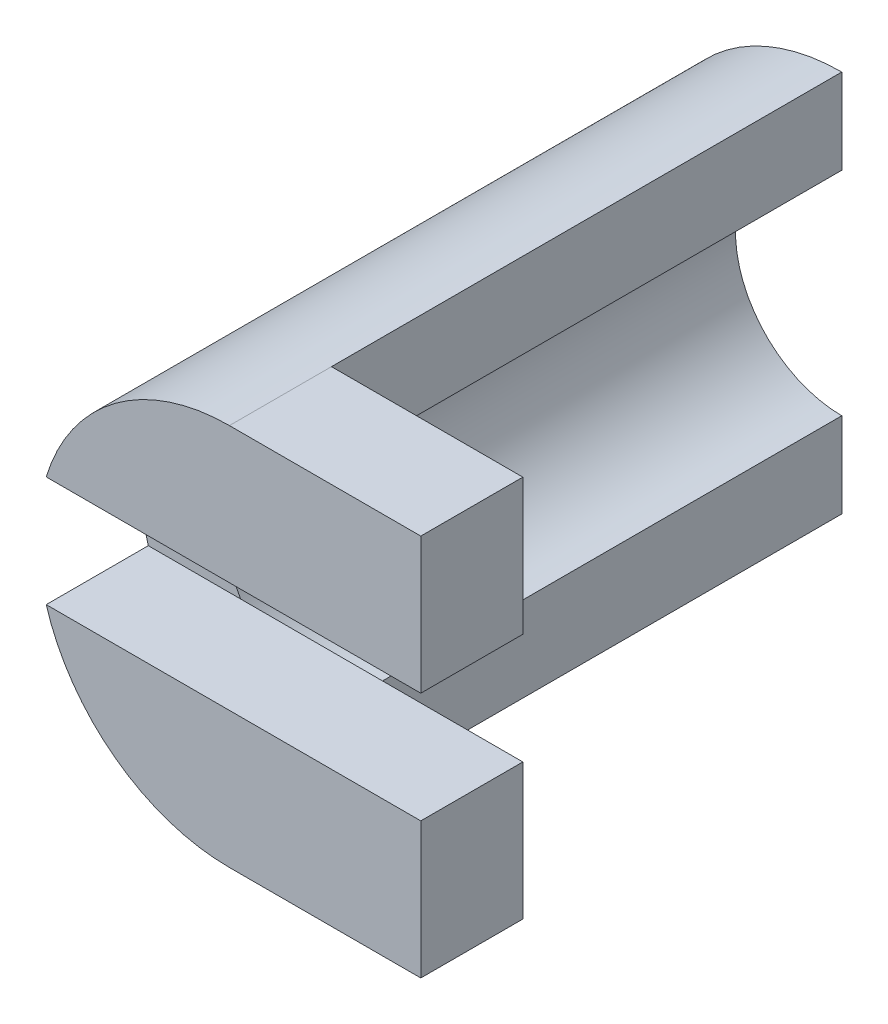
ISO-10303-21;
HEADER;
FILE_DESCRIPTION(('STEP AP214'),'2;1');
FILE_NAME('part.step','',(''),(''),'','','');
FILE_SCHEMA(('AUTOMOTIVE_DESIGN { 1 0 10303 214 1 1 1 1 }'));
ENDSEC;
DATA;
#1=APPLICATION_CONTEXT('core data for automotive mechanical design processes');
#2=APPLICATION_PROTOCOL_DEFINITION('international standard','automotive_design',2000,#1);
#3=PRODUCT_CONTEXT('',#1,'mechanical');
#4=PRODUCT('Part','Part','',(#3));
#5=PRODUCT_RELATED_PRODUCT_CATEGORY('part','',(#4));
#6=PRODUCT_DEFINITION_FORMATION('','',#4);
#7=PRODUCT_DEFINITION_CONTEXT('part definition',#1,'design');
#8=PRODUCT_DEFINITION('design','',#6,#7);
#9=PRODUCT_DEFINITION_SHAPE('','',#8);
#10=(LENGTH_UNIT() NAMED_UNIT(*) SI_UNIT(.MILLI.,.METRE.));
#11=(NAMED_UNIT(*) PLANE_ANGLE_UNIT() SI_UNIT($,.RADIAN.));
#12=(NAMED_UNIT(*) SI_UNIT($,.STERADIAN.) SOLID_ANGLE_UNIT());
#13=UNCERTAINTY_MEASURE_WITH_UNIT(LENGTH_MEASURE(1.E-05),#10,'distance_accuracy_value','');
#14=(GEOMETRIC_REPRESENTATION_CONTEXT(3) GLOBAL_UNCERTAINTY_ASSIGNED_CONTEXT((#13)) GLOBAL_UNIT_ASSIGNED_CONTEXT((#10,
#11,#12)) REPRESENTATION_CONTEXT('',''));
#15=CARTESIAN_POINT('',(0.,0.,0.));
#16=DIRECTION('',(0.,0.,1.));
#17=DIRECTION('',(1.,0.,0.));
#18=AXIS2_PLACEMENT_3D('',#15,#16,#17);
#19=CARTESIAN_POINT('',(0.,0.,30.));
#20=DIRECTION('',(0.,0.,-1.));
#21=DIRECTION('',(-1.,0.,0.));
#22=AXIS2_PLACEMENT_3D('',#19,#20,#21);
#23=CYLINDRICAL_SURFACE('',#22,6.25);
#24=CARTESIAN_POINT('',(0.,0.,0.));
#25=DIRECTION('',(0.,0.,-1.));
#26=DIRECTION('',(1.,0.,0.));
#27=AXIS2_PLACEMENT_3D('',#24,#25,#26);
#28=CIRCLE('',#27,6.25);
#29=CARTESIAN_POINT('',(0.,-6.25,0.));
#30=VERTEX_POINT('',#29);
#31=CARTESIAN_POINT('',(0.,6.25,0.));
#32=VERTEX_POINT('',#31);
#33=EDGE_CURVE('E197',#30,#32,#28,.T.);
#34=ORIENTED_EDGE('',*,*,#33,.T.);
#35=DIRECTION('',(0.,0.,-1.));
#36=VECTOR('',#35,1.);
#37=CARTESIAN_POINT('',(0.,6.25,30.));
#38=LINE('',#37,#36);
#39=CARTESIAN_POINT('',(0.,6.25,30.));
#40=VERTEX_POINT('',#39);
#41=EDGE_CURVE('E11',#40,#32,#38,.T.);
#42=ORIENTED_EDGE('',*,*,#41,.F.);
#43=CARTESIAN_POINT('',(0.,0.,30.));
#44=DIRECTION('',(0.,0.,-1.));
#45=DIRECTION('',(1.,0.,0.));
#46=AXIS2_PLACEMENT_3D('',#43,#44,#45);
#47=CIRCLE('',#46,6.25);
#48=CARTESIAN_POINT('',(-5.33853912601566,3.25,30.));
#49=VERTEX_POINT('',#48);
#50=EDGE_CURVE('E203',#49,#40,#47,.T.);
#51=ORIENTED_EDGE('',*,*,#50,.F.);
#52=CARTESIAN_POINT('',(-5.33853912601566,-3.25,30.));
#53=VERTEX_POINT('',#52);
#54=EDGE_CURVE('E202',#53,#49,#47,.T.);
#55=ORIENTED_EDGE('',*,*,#54,.F.);
#56=CARTESIAN_POINT('',(0.,-6.25,30.));
#57=VERTEX_POINT('',#56);
#58=EDGE_CURVE('E198',#57,#53,#47,.T.);
#59=ORIENTED_EDGE('',*,*,#58,.F.);
#60=DIRECTION('',(0.,0.,-1.));
#61=VECTOR('',#60,1.);
#62=CARTESIAN_POINT('',(0.,-6.25,30.));
#63=LINE('',#62,#61);
#64=EDGE_CURVE('E210',#57,#30,#63,.T.);
#65=ORIENTED_EDGE('',*,*,#64,.T.);
#66=EDGE_LOOP('',(#34,#42,#51,#55,#59,#65));
#67=FACE_BOUND('',#66,.T.);
#68=ADVANCED_FACE('F39',(#67),#23,.F.);
#69=CARTESIAN_POINT('',(0.,6.25,30.));
#70=DIRECTION('',(-1.,0.,0.));
#71=DIRECTION('',(0.,-1.,0.));
#72=AXIS2_PLACEMENT_3D('',#69,#70,#71);
#73=PLANE('',#72);
#74=DIRECTION('',(0.,1.,0.));
#75=VECTOR('',#74,1.);
#76=CARTESIAN_POINT('',(0.,6.25,0.));
#77=LINE('',#76,#75);
#78=CARTESIAN_POINT('',(0.,11.25,0.));
#79=VERTEX_POINT('',#78);
#80=EDGE_CURVE('E213',#32,#79,#77,.T.);
#81=ORIENTED_EDGE('',*,*,#80,.T.);
#82=DIRECTION('',(0.,0.,-1.));
#83=VECTOR('',#82,1.);
#84=CARTESIAN_POINT('',(0.,11.25,30.));
#85=LINE('',#84,#83);
#86=CARTESIAN_POINT('',(0.,11.25,30.));
#87=VERTEX_POINT('',#86);
#88=EDGE_CURVE('E46',#87,#79,#85,.T.);
#89=ORIENTED_EDGE('',*,*,#88,.F.);
#90=DIRECTION('',(0.,1.,0.));
#91=VECTOR('',#90,1.);
#92=CARTESIAN_POINT('',(0.,6.25,30.));
#93=LINE('',#92,#91);
#94=EDGE_CURVE('E201',#40,#87,#93,.T.);
#95=ORIENTED_EDGE('',*,*,#94,.F.);
#96=ORIENTED_EDGE('',*,*,#41,.T.);
#97=EDGE_LOOP('',(#81,#89,#95,#96));
#98=FACE_BOUND('',#97,.T.);
#99=ADVANCED_FACE('F256',(#98),#73,.F.);
#100=CARTESIAN_POINT('',(0.,0.,30.));
#101=DIRECTION('',(0.,0.,-1.));
#102=DIRECTION('',(-1.,0.,0.));
#103=AXIS2_PLACEMENT_3D('',#100,#101,#102);
#104=CYLINDRICAL_SURFACE('',#103,11.25);
#105=CARTESIAN_POINT('',(0.,0.,0.));
#106=DIRECTION('',(0.,0.,1.));
#107=DIRECTION('',(1.,0.,0.));
#108=AXIS2_PLACEMENT_3D('',#105,#106,#107);
#109=CIRCLE('',#108,11.25);
#110=CARTESIAN_POINT('',(0.,-11.25,0.));
#111=VERTEX_POINT('',#110);
#112=EDGE_CURVE('E215',#79,#111,#109,.T.);
#113=ORIENTED_EDGE('',*,*,#112,.T.);
#114=DIRECTION('',(0.,0.,-1.));
#115=VECTOR('',#114,1.);
#116=CARTESIAN_POINT('',(0.,-11.25,30.));
#117=LINE('',#116,#115);
#118=CARTESIAN_POINT('',(0.,-11.25,30.));
#119=VERTEX_POINT('',#118);
#120=EDGE_CURVE('E221',#119,#111,#117,.T.);
#121=ORIENTED_EDGE('',*,*,#120,.F.);
#122=DIRECTION('',(0.,0.,-1.));
#123=VECTOR('',#122,1.);
#124=CARTESIAN_POINT('',(0.,-11.25,36.));
#125=LINE('',#124,#123);
#126=CARTESIAN_POINT('',(0.,-11.25,36.));
#127=VERTEX_POINT('',#126);
#128=EDGE_CURVE('E135',#127,#119,#125,.T.);
#129=ORIENTED_EDGE('',*,*,#128,.F.);
#130=CARTESIAN_POINT('',(0.,0.,36.));
#131=DIRECTION('',(0.,0.,1.));
#132=DIRECTION('',(1.,0.,0.));
#133=AXIS2_PLACEMENT_3D('',#130,#131,#132);
#134=CIRCLE('',#133,11.25);
#135=CARTESIAN_POINT('',(-10.770329614269,-3.25,36.));
#136=VERTEX_POINT('',#135);
#137=EDGE_CURVE('E138',#136,#127,#134,.T.);
#138=ORIENTED_EDGE('',*,*,#137,.F.);
#139=DIRECTION('',(0.,0.,-1.));
#140=VECTOR('',#139,1.);
#141=CARTESIAN_POINT('',(-10.770329614269,-3.25,36.));
#142=LINE('',#141,#140);
#143=CARTESIAN_POINT('',(-10.770329614269,-3.25,30.));
#144=VERTEX_POINT('',#143);
#145=EDGE_CURVE('E125',#136,#144,#142,.T.);
#146=ORIENTED_EDGE('',*,*,#145,.T.);
#147=CARTESIAN_POINT('',(0.,0.,30.));
#148=DIRECTION('',(0.,0.,1.));
#149=DIRECTION('',(1.,0.,0.));
#150=AXIS2_PLACEMENT_3D('',#147,#148,#149);
#151=CIRCLE('',#150,11.25);
#152=CARTESIAN_POINT('',(-10.770329614269,3.25,30.));
#153=VERTEX_POINT('',#152);
#154=EDGE_CURVE('E58',#153,#144,#151,.T.);
#155=ORIENTED_EDGE('',*,*,#154,.F.);
#156=DIRECTION('',(0.,0.,-1.));
#157=VECTOR('',#156,1.);
#158=CARTESIAN_POINT('',(-10.770329614269,3.25,36.));
#159=LINE('',#158,#157);
#160=CARTESIAN_POINT('',(-10.770329614269,3.25,36.));
#161=VERTEX_POINT('',#160);
#162=EDGE_CURVE('E194',#161,#153,#159,.T.);
#163=ORIENTED_EDGE('',*,*,#162,.F.);
#164=CARTESIAN_POINT('',(0.,0.,36.));
#165=DIRECTION('',(0.,0.,1.));
#166=DIRECTION('',(1.,0.,0.));
#167=AXIS2_PLACEMENT_3D('',#164,#165,#166);
#168=CIRCLE('',#167,11.25);
#169=CARTESIAN_POINT('',(0.,11.25,36.));
#170=VERTEX_POINT('',#169);
#171=EDGE_CURVE('E167',#170,#161,#168,.T.);
#172=ORIENTED_EDGE('',*,*,#171,.F.);
#173=DIRECTION('',(0.,0.,-1.));
#174=VECTOR('',#173,1.);
#175=CARTESIAN_POINT('',(0.,11.25,36.));
#176=LINE('',#175,#174);
#177=EDGE_CURVE('E178',#170,#87,#176,.T.);
#178=ORIENTED_EDGE('',*,*,#177,.T.);
#179=ORIENTED_EDGE('',*,*,#88,.T.);
#180=EDGE_LOOP('',(#113,#121,#129,#138,#146,#155,#163,#172,#178,#179));
#181=FACE_BOUND('',#180,.T.);
#182=ADVANCED_FACE('F139',(#181),#104,.T.);
#183=CARTESIAN_POINT('',(0.,-6.25,30.));
#184=DIRECTION('',(-1.,0.,0.));
#185=DIRECTION('',(0.,-1.,0.));
#186=AXIS2_PLACEMENT_3D('',#183,#184,#185);
#187=PLANE('',#186);
#188=DIRECTION('',(0.,1.,0.));
#189=VECTOR('',#188,1.);
#190=CARTESIAN_POINT('',(0.,-6.25,0.));
#191=LINE('',#190,#189);
#192=EDGE_CURVE('E217',#111,#30,#191,.T.);
#193=ORIENTED_EDGE('',*,*,#192,.T.);
#194=ORIENTED_EDGE('',*,*,#64,.F.);
#195=DIRECTION('',(0.,1.,0.));
#196=VECTOR('',#195,1.);
#197=CARTESIAN_POINT('',(0.,-6.25,30.));
#198=LINE('',#197,#196);
#199=EDGE_CURVE('E207',#119,#57,#198,.T.);
#200=ORIENTED_EDGE('',*,*,#199,.F.);
#201=ORIENTED_EDGE('',*,*,#120,.T.);
#202=EDGE_LOOP('',(#193,#194,#200,#201));
#203=FACE_BOUND('',#202,.T.);
#204=ADVANCED_FACE('F233',(#203),#187,.F.);
#205=CARTESIAN_POINT('',(0.,0.,30.));
#206=DIRECTION('',(0.,0.,1.));
#207=DIRECTION('',(1.,0.,0.));
#208=AXIS2_PLACEMENT_3D('',#205,#206,#207);
#209=PLANE('',#208);
#210=DIRECTION('',(1.,0.,0.));
#211=VECTOR('',#210,1.);
#212=CARTESIAN_POINT('',(0.,-3.25,30.));
#213=LINE('',#212,#211);
#214=EDGE_CURVE('E53',#144,#53,#213,.T.);
#215=ORIENTED_EDGE('',*,*,#214,.T.);
#216=ORIENTED_EDGE('',*,*,#54,.T.);
#217=DIRECTION('',(1.,0.,0.));
#218=VECTOR('',#217,1.);
#219=CARTESIAN_POINT('',(0.,3.25,30.));
#220=LINE('',#219,#218);
#221=EDGE_CURVE('E179',#153,#49,#220,.T.);
#222=ORIENTED_EDGE('',*,*,#221,.F.);
#223=ORIENTED_EDGE('',*,*,#154,.T.);
#224=EDGE_LOOP('',(#215,#216,#222,#223));
#225=FACE_BOUND('',#224,.T.);
#226=ADVANCED_FACE('F268',(#225),#209,.T.);
#227=CARTESIAN_POINT('',(0.,0.,0.));
#228=DIRECTION('',(0.,0.,1.));
#229=DIRECTION('',(1.,0.,0.));
#230=AXIS2_PLACEMENT_3D('',#227,#228,#229);
#231=PLANE('',#230);
#232=ORIENTED_EDGE('',*,*,#33,.F.);
#233=ORIENTED_EDGE('',*,*,#192,.F.);
#234=ORIENTED_EDGE('',*,*,#112,.F.);
#235=ORIENTED_EDGE('',*,*,#80,.F.);
#236=EDGE_LOOP('',(#232,#233,#234,#235));
#237=FACE_BOUND('',#236,.T.);
#238=ADVANCED_FACE('F231',(#237),#231,.F.);
#239=CARTESIAN_POINT('',(0.,0.,30.));
#240=DIRECTION('',(0.,0.,1.));
#241=DIRECTION('',(1.,0.,0.));
#242=AXIS2_PLACEMENT_3D('',#239,#240,#241);
#243=PLANE('',#242);
#244=CARTESIAN_POINT('',(11.25,3.25,30.));
#245=VERTEX_POINT('',#244);
#246=EDGE_CURVE('E134',#49,#245,#220,.T.);
#247=ORIENTED_EDGE('',*,*,#246,.F.);
#248=ORIENTED_EDGE('',*,*,#50,.T.);
#249=ORIENTED_EDGE('',*,*,#94,.T.);
#250=DIRECTION('',(-1.,0.,0.));
#251=VECTOR('',#250,1.);
#252=CARTESIAN_POINT('',(0.,11.25,30.));
#253=LINE('',#252,#251);
#254=CARTESIAN_POINT('',(11.25,11.25,30.));
#255=VERTEX_POINT('',#254);
#256=EDGE_CURVE('E171',#255,#87,#253,.T.);
#257=ORIENTED_EDGE('',*,*,#256,.F.);
#258=DIRECTION('',(0.,-1.,0.));
#259=VECTOR('',#258,1.);
#260=CARTESIAN_POINT('',(11.25,0.,30.));
#261=LINE('',#260,#259);
#262=EDGE_CURVE('E182',#255,#245,#261,.T.);
#263=ORIENTED_EDGE('',*,*,#262,.T.);
#264=EDGE_LOOP('',(#247,#248,#249,#257,#263));
#265=FACE_BOUND('',#264,.T.);
#266=ADVANCED_FACE('F270',(#265),#243,.F.);
#267=CARTESIAN_POINT('',(0.,3.25,36.));
#268=DIRECTION('',(0.,1.,0.));
#269=DIRECTION('',(0.,0.,1.));
#270=AXIS2_PLACEMENT_3D('',#267,#268,#269);
#271=PLANE('',#270);
#272=ORIENTED_EDGE('',*,*,#221,.T.);
#273=ORIENTED_EDGE('',*,*,#246,.T.);
#274=DIRECTION('',(0.,0.,-1.));
#275=VECTOR('',#274,1.);
#276=CARTESIAN_POINT('',(11.25,3.25,36.));
#277=LINE('',#276,#275);
#278=CARTESIAN_POINT('',(11.25,3.25,36.));
#279=VERTEX_POINT('',#278);
#280=EDGE_CURVE('E191',#279,#245,#277,.T.);
#281=ORIENTED_EDGE('',*,*,#280,.F.);
#282=DIRECTION('',(1.,0.,0.));
#283=VECTOR('',#282,1.);
#284=CARTESIAN_POINT('',(0.,3.25,36.));
#285=LINE('',#284,#283);
#286=EDGE_CURVE('E170',#161,#279,#285,.T.);
#287=ORIENTED_EDGE('',*,*,#286,.F.);
#288=ORIENTED_EDGE('',*,*,#162,.T.);
#289=EDGE_LOOP('',(#272,#273,#281,#287,#288));
#290=FACE_BOUND('',#289,.T.);
#291=ADVANCED_FACE('F273',(#290),#271,.F.);
#292=CARTESIAN_POINT('',(11.25,0.,36.));
#293=DIRECTION('',(1.,0.,0.));
#294=DIRECTION('',(0.,0.,-1.));
#295=AXIS2_PLACEMENT_3D('',#292,#293,#294);
#296=PLANE('',#295);
#297=ORIENTED_EDGE('',*,*,#262,.F.);
#298=DIRECTION('',(0.,0.,-1.));
#299=VECTOR('',#298,1.);
#300=CARTESIAN_POINT('',(11.25,11.25,36.));
#301=LINE('',#300,#299);
#302=CARTESIAN_POINT('',(11.25,11.25,36.));
#303=VERTEX_POINT('',#302);
#304=EDGE_CURVE('E189',#303,#255,#301,.T.);
#305=ORIENTED_EDGE('',*,*,#304,.F.);
#306=DIRECTION('',(0.,-1.,0.));
#307=VECTOR('',#306,1.);
#308=CARTESIAN_POINT('',(11.25,0.,36.));
#309=LINE('',#308,#307);
#310=EDGE_CURVE('E173',#303,#279,#309,.T.);
#311=ORIENTED_EDGE('',*,*,#310,.T.);
#312=ORIENTED_EDGE('',*,*,#280,.T.);
#313=EDGE_LOOP('',(#297,#305,#311,#312));
#314=FACE_BOUND('',#313,.T.);
#315=ADVANCED_FACE('F276',(#314),#296,.T.);
#316=CARTESIAN_POINT('',(0.,11.25,36.));
#317=DIRECTION('',(0.,-1.,0.));
#318=DIRECTION('',(0.,0.,-1.));
#319=AXIS2_PLACEMENT_3D('',#316,#317,#318);
#320=PLANE('',#319);
#321=ORIENTED_EDGE('',*,*,#256,.T.);
#322=ORIENTED_EDGE('',*,*,#177,.F.);
#323=DIRECTION('',(-1.,0.,0.));
#324=VECTOR('',#323,1.);
#325=CARTESIAN_POINT('',(0.,11.25,36.));
#326=LINE('',#325,#324);
#327=EDGE_CURVE('E176',#303,#170,#326,.T.);
#328=ORIENTED_EDGE('',*,*,#327,.F.);
#329=ORIENTED_EDGE('',*,*,#304,.T.);
#330=EDGE_LOOP('',(#321,#322,#328,#329));
#331=FACE_BOUND('',#330,.T.);
#332=ADVANCED_FACE('F280',(#331),#320,.F.);
#333=CARTESIAN_POINT('',(0.,0.,36.));
#334=DIRECTION('',(0.,0.,1.));
#335=DIRECTION('',(1.,0.,0.));
#336=AXIS2_PLACEMENT_3D('',#333,#334,#335);
#337=PLANE('',#336);
#338=ORIENTED_EDGE('',*,*,#171,.T.);
#339=ORIENTED_EDGE('',*,*,#286,.T.);
#340=ORIENTED_EDGE('',*,*,#310,.F.);
#341=ORIENTED_EDGE('',*,*,#327,.T.);
#342=EDGE_LOOP('',(#338,#339,#340,#341));
#343=FACE_BOUND('',#342,.T.);
#344=ADVANCED_FACE('F284',(#343),#337,.T.);
#345=CARTESIAN_POINT('',(0.,0.,30.));
#346=DIRECTION('',(0.,0.,1.));
#347=DIRECTION('',(1.,0.,0.));
#348=AXIS2_PLACEMENT_3D('',#345,#346,#347);
#349=PLANE('',#348);
#350=ORIENTED_EDGE('',*,*,#199,.T.);
#351=ORIENTED_EDGE('',*,*,#58,.T.);
#352=CARTESIAN_POINT('',(11.25,-3.25,30.));
#353=VERTEX_POINT('',#352);
#354=EDGE_CURVE('E160',#53,#353,#213,.T.);
#355=ORIENTED_EDGE('',*,*,#354,.T.);
#356=DIRECTION('',(0.,-1.,0.));
#357=VECTOR('',#356,1.);
#358=CARTESIAN_POINT('',(11.25,0.,30.));
#359=LINE('',#358,#357);
#360=CARTESIAN_POINT('',(11.25,-11.25,30.));
#361=VERTEX_POINT('',#360);
#362=EDGE_CURVE('E150',#353,#361,#359,.T.);
#363=ORIENTED_EDGE('',*,*,#362,.T.);
#364=DIRECTION('',(-1.,0.,0.));
#365=VECTOR('',#364,1.);
#366=CARTESIAN_POINT('',(0.,-11.25,30.));
#367=LINE('',#366,#365);
#368=EDGE_CURVE('E153',#361,#119,#367,.T.);
#369=ORIENTED_EDGE('',*,*,#368,.T.);
#370=EDGE_LOOP('',(#350,#351,#355,#363,#369));
#371=FACE_BOUND('',#370,.T.);
#372=ADVANCED_FACE('F239',(#371),#349,.F.);
#373=CARTESIAN_POINT('',(0.,-3.25,36.));
#374=DIRECTION('',(0.,1.,0.));
#375=DIRECTION('',(0.,0.,1.));
#376=AXIS2_PLACEMENT_3D('',#373,#374,#375);
#377=PLANE('',#376);
#378=ORIENTED_EDGE('',*,*,#214,.F.);
#379=ORIENTED_EDGE('',*,*,#145,.F.);
#380=DIRECTION('',(1.,0.,0.));
#381=VECTOR('',#380,1.);
#382=CARTESIAN_POINT('',(0.,-3.25,36.));
#383=LINE('',#382,#381);
#384=CARTESIAN_POINT('',(11.25,-3.25,36.));
#385=VERTEX_POINT('',#384);
#386=EDGE_CURVE('E130',#136,#385,#383,.T.);
#387=ORIENTED_EDGE('',*,*,#386,.T.);
#388=DIRECTION('',(0.,0.,-1.));
#389=VECTOR('',#388,1.);
#390=CARTESIAN_POINT('',(11.25,-3.25,36.));
#391=LINE('',#390,#389);
#392=EDGE_CURVE('E158',#385,#353,#391,.T.);
#393=ORIENTED_EDGE('',*,*,#392,.T.);
#394=ORIENTED_EDGE('',*,*,#354,.F.);
#395=EDGE_LOOP('',(#378,#379,#387,#393,#394));
#396=FACE_BOUND('',#395,.T.);
#397=ADVANCED_FACE('F127',(#396),#377,.T.);
#398=CARTESIAN_POINT('',(0.,-11.25,36.));
#399=DIRECTION('',(0.,-1.,0.));
#400=DIRECTION('',(0.,0.,-1.));
#401=AXIS2_PLACEMENT_3D('',#398,#399,#400);
#402=PLANE('',#401);
#403=ORIENTED_EDGE('',*,*,#368,.F.);
#404=DIRECTION('',(0.,0.,-1.));
#405=VECTOR('',#404,1.);
#406=CARTESIAN_POINT('',(11.25,-11.25,36.));
#407=LINE('',#406,#405);
#408=CARTESIAN_POINT('',(11.25,-11.25,36.));
#409=VERTEX_POINT('',#408);
#410=EDGE_CURVE('E164',#409,#361,#407,.T.);
#411=ORIENTED_EDGE('',*,*,#410,.F.);
#412=DIRECTION('',(-1.,0.,0.));
#413=VECTOR('',#412,1.);
#414=CARTESIAN_POINT('',(0.,-11.25,36.));
#415=LINE('',#414,#413);
#416=EDGE_CURVE('E145',#409,#127,#415,.T.);
#417=ORIENTED_EDGE('',*,*,#416,.T.);
#418=ORIENTED_EDGE('',*,*,#128,.T.);
#419=EDGE_LOOP('',(#403,#411,#417,#418));
#420=FACE_BOUND('',#419,.T.);
#421=ADVANCED_FACE('F242',(#420),#402,.T.);
#422=CARTESIAN_POINT('',(11.25,0.,36.));
#423=DIRECTION('',(1.,0.,0.));
#424=DIRECTION('',(0.,0.,-1.));
#425=AXIS2_PLACEMENT_3D('',#422,#423,#424);
#426=PLANE('',#425);
#427=ORIENTED_EDGE('',*,*,#362,.F.);
#428=ORIENTED_EDGE('',*,*,#392,.F.);
#429=DIRECTION('',(0.,-1.,0.));
#430=VECTOR('',#429,1.);
#431=CARTESIAN_POINT('',(11.25,0.,36.));
#432=LINE('',#431,#430);
#433=EDGE_CURVE('E149',#385,#409,#432,.T.);
#434=ORIENTED_EDGE('',*,*,#433,.T.);
#435=ORIENTED_EDGE('',*,*,#410,.T.);
#436=EDGE_LOOP('',(#427,#428,#434,#435));
#437=FACE_BOUND('',#436,.T.);
#438=ADVANCED_FACE('F245',(#437),#426,.T.);
#439=CARTESIAN_POINT('',(0.,0.,36.));
#440=DIRECTION('',(0.,0.,1.));
#441=DIRECTION('',(1.,0.,0.));
#442=AXIS2_PLACEMENT_3D('',#439,#440,#441);
#443=PLANE('',#442);
#444=ORIENTED_EDGE('',*,*,#386,.F.);
#445=ORIENTED_EDGE('',*,*,#137,.T.);
#446=ORIENTED_EDGE('',*,*,#416,.F.);
#447=ORIENTED_EDGE('',*,*,#433,.F.);
#448=EDGE_LOOP('',(#444,#445,#446,#447));
#449=FACE_BOUND('',#448,.T.);
#450=ADVANCED_FACE('F147',(#449),#443,.T.);
#451=CLOSED_SHELL('',(#68,#99,#182,#204,#226,#238,#266,#291,#315,#332,#344,#372,#397,#421,#438,#450));
#452=MANIFOLD_SOLID_BREP('B2',#451);
#453=ADVANCED_BREP_SHAPE_REPRESENTATION('',(#18,#452),#14);
#454=SHAPE_DEFINITION_REPRESENTATION(#9,#453);
ENDSEC;
END-ISO-10303-21;
